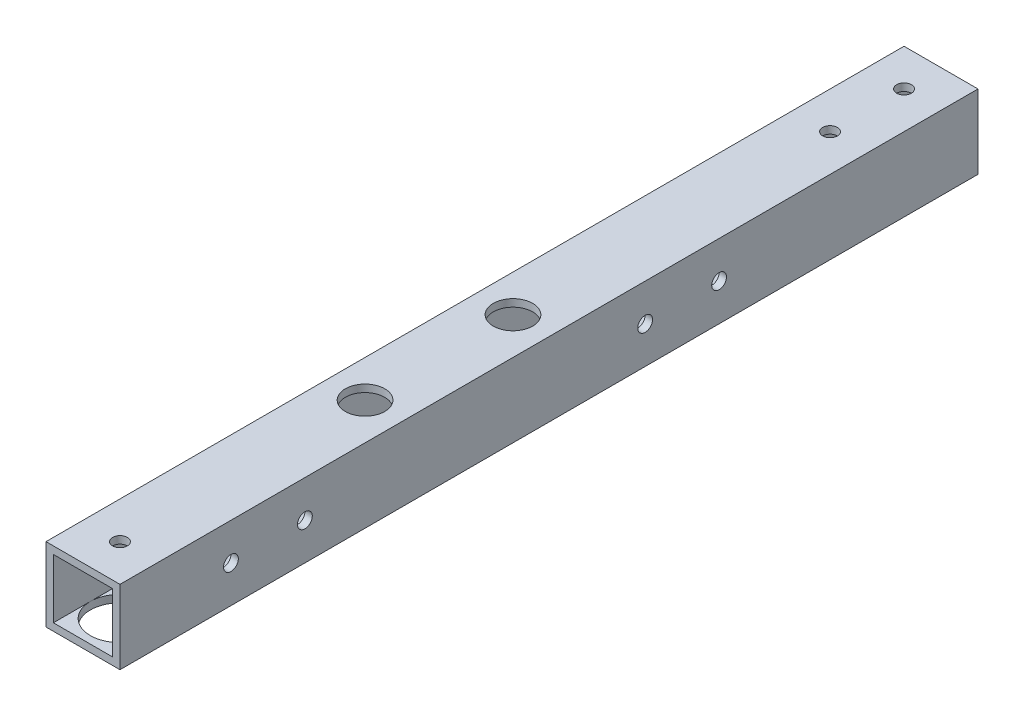
ISO-10303-21;
HEADER;
FILE_DESCRIPTION(('STEP AP214'),'2;1');
FILE_NAME('part.step','',(''),(''),'','','');
FILE_SCHEMA(('AUTOMOTIVE_DESIGN { 1 0 10303 214 1 1 1 1 }'));
ENDSEC;
DATA;
#1=APPLICATION_CONTEXT('core data for automotive mechanical design processes');
#2=APPLICATION_PROTOCOL_DEFINITION('international standard','automotive_design',2000,#1);
#3=PRODUCT_CONTEXT('',#1,'mechanical');
#4=PRODUCT('Part','Part','',(#3));
#5=PRODUCT_RELATED_PRODUCT_CATEGORY('part','',(#4));
#6=PRODUCT_DEFINITION_FORMATION('','',#4);
#7=PRODUCT_DEFINITION_CONTEXT('part definition',#1,'design');
#8=PRODUCT_DEFINITION('design','',#6,#7);
#9=PRODUCT_DEFINITION_SHAPE('','',#8);
#10=(LENGTH_UNIT() NAMED_UNIT(*) SI_UNIT(.MILLI.,.METRE.));
#11=(NAMED_UNIT(*) PLANE_ANGLE_UNIT() SI_UNIT($,.RADIAN.));
#12=(NAMED_UNIT(*) SI_UNIT($,.STERADIAN.) SOLID_ANGLE_UNIT());
#13=UNCERTAINTY_MEASURE_WITH_UNIT(LENGTH_MEASURE(1.E-05),#10,'distance_accuracy_value','');
#14=(GEOMETRIC_REPRESENTATION_CONTEXT(3) GLOBAL_UNCERTAINTY_ASSIGNED_CONTEXT((#13)) GLOBAL_UNIT_ASSIGNED_CONTEXT((#10,
#11,#12)) REPRESENTATION_CONTEXT('',''));
#15=CARTESIAN_POINT('',(0.,0.,0.));
#16=DIRECTION('',(0.,0.,1.));
#17=DIRECTION('',(1.,0.,0.));
#18=AXIS2_PLACEMENT_3D('',#15,#16,#17);
#19=CARTESIAN_POINT('',(-5.51008414074451,-5.76737391420748,174.));
#20=DIRECTION('',(0.,1.,0.));
#21=DIRECTION('',(0.,0.,1.));
#22=AXIS2_PLACEMENT_3D('',#19,#20,#21);
#23=PLANE('',#22);
#24=CARTESIAN_POINT('',(0.489915859255485,-5.76737391420748,22.5));
#25=DIRECTION('',(0.,1.,0.));
#26=DIRECTION('',(0.,0.,1.));
#27=AXIS2_PLACEMENT_3D('',#24,#25,#26);
#28=CIRCLE('',#27,6.);
#29=CARTESIAN_POINT('',(6.48991585925549,-5.76737391420748,22.5));
#30=VERTEX_POINT('',#29);
#31=CARTESIAN_POINT('',(-5.51008414074451,-5.76737391420748,22.5));
#32=VERTEX_POINT('',#31);
#33=EDGE_CURVE('E49',#30,#32,#28,.T.);
#34=ORIENTED_EDGE('',*,*,#33,.F.);
#35=DIRECTION('',(0.,0.,-1.));
#36=VECTOR('',#35,1.);
#37=CARTESIAN_POINT('',(6.48991585925549,-5.76737391420748,174.));
#38=LINE('',#37,#36);
#39=CARTESIAN_POINT('',(6.48991585925549,-5.76737391420748,0.));
#40=VERTEX_POINT('',#39);
#41=EDGE_CURVE('E121',#30,#40,#38,.T.);
#42=ORIENTED_EDGE('',*,*,#41,.T.);
#43=DIRECTION('',(1.,0.,0.));
#44=VECTOR('',#43,1.);
#45=CARTESIAN_POINT('',(-5.51008414074451,-5.76737391420748,0.));
#46=LINE('',#45,#44);
#47=CARTESIAN_POINT('',(-5.51008414074451,-5.76737391420748,0.));
#48=VERTEX_POINT('',#47);
#49=EDGE_CURVE('E281',#48,#40,#46,.T.);
#50=ORIENTED_EDGE('',*,*,#49,.F.);
#51=DIRECTION('',(0.,0.,-1.));
#52=VECTOR('',#51,1.);
#53=CARTESIAN_POINT('',(-5.51008414074451,-5.76737391420748,174.));
#54=LINE('',#53,#52);
#55=EDGE_CURVE('E123',#32,#48,#54,.T.);
#56=ORIENTED_EDGE('',*,*,#55,.F.);
#57=EDGE_LOOP('',(#34,#42,#50,#56));
#58=FACE_BOUND('',#57,.T.);
#59=ADVANCED_FACE('F33',(#58),#23,.T.);
#60=EDGE_CURVE('E109',#32,#30,#28,.T.);
#61=ORIENTED_EDGE('',*,*,#60,.F.);
#62=CARTESIAN_POINT('',(-5.51008414074451,-5.76737391420748,166.5));
#63=VERTEX_POINT('',#62);
#64=EDGE_CURVE('E147',#63,#32,#54,.T.);
#65=ORIENTED_EDGE('',*,*,#64,.F.);
#66=CARTESIAN_POINT('',(0.489915859255487,-5.76737391420748,166.5));
#67=DIRECTION('',(0.,1.,0.));
#68=DIRECTION('',(0.,0.,1.));
#69=AXIS2_PLACEMENT_3D('',#66,#67,#68);
#70=CIRCLE('',#69,6.);
#71=CARTESIAN_POINT('',(6.48991585925549,-5.76737391420748,166.5));
#72=VERTEX_POINT('',#71);
#73=EDGE_CURVE('E56',#72,#63,#70,.T.);
#74=ORIENTED_EDGE('',*,*,#73,.F.);
#75=EDGE_CURVE('E131',#72,#30,#38,.T.);
#76=ORIENTED_EDGE('',*,*,#75,.T.);
#77=EDGE_LOOP('',(#61,#65,#74,#76));
#78=FACE_BOUND('',#77,.T.);
#79=ADVANCED_FACE('F139',(#78),#23,.T.);
#80=CARTESIAN_POINT('',(0.,0.,174.));
#81=DIRECTION('',(0.,0.,1.));
#82=DIRECTION('',(1.,0.,0.));
#83=AXIS2_PLACEMENT_3D('',#80,#81,#82);
#84=PLANE('',#83);
#85=DIRECTION('',(0.,-1.,0.));
#86=VECTOR('',#85,1.);
#87=CARTESIAN_POINT('',(-7.01008414074451,7.73262608579252,174.));
#88=LINE('',#87,#86);
#89=CARTESIAN_POINT('',(-7.01008414074451,7.73262608579252,174.));
#90=VERTEX_POINT('',#89);
#91=CARTESIAN_POINT('',(-7.01008414074451,-7.26737391420748,174.));
#92=VERTEX_POINT('',#91);
#93=EDGE_CURVE('E148',#90,#92,#88,.T.);
#94=ORIENTED_EDGE('',*,*,#93,.T.);
#95=DIRECTION('',(1.,0.,0.));
#96=VECTOR('',#95,1.);
#97=CARTESIAN_POINT('',(-7.01008414074451,-7.26737391420748,174.));
#98=LINE('',#97,#96);
#99=CARTESIAN_POINT('',(7.98991585925548,-7.26737391420748,174.));
#100=VERTEX_POINT('',#99);
#101=EDGE_CURVE('E151',#92,#100,#98,.T.);
#102=ORIENTED_EDGE('',*,*,#101,.T.);
#103=DIRECTION('',(0.,1.,0.));
#104=VECTOR('',#103,1.);
#105=CARTESIAN_POINT('',(7.98991585925549,7.73262608579252,174.));
#106=LINE('',#105,#104);
#107=CARTESIAN_POINT('',(7.98991585925549,7.73262608579252,174.));
#108=VERTEX_POINT('',#107);
#109=EDGE_CURVE('E154',#100,#108,#106,.T.);
#110=ORIENTED_EDGE('',*,*,#109,.T.);
#111=DIRECTION('',(-1.,0.,0.));
#112=VECTOR('',#111,1.);
#113=CARTESIAN_POINT('',(-7.01008414074451,7.73262608579252,174.));
#114=LINE('',#113,#112);
#115=EDGE_CURVE('E156',#108,#90,#114,.T.);
#116=ORIENTED_EDGE('',*,*,#115,.T.);
#117=EDGE_LOOP('',(#94,#102,#110,#116));
#118=FACE_BOUND('',#117,.T.);
#119=DIRECTION('',(1.,0.,0.));
#120=VECTOR('',#119,1.);
#121=CARTESIAN_POINT('',(-5.51008414074451,-5.76737391420748,174.));
#122=LINE('',#121,#120);
#123=CARTESIAN_POINT('',(-5.51008414074451,-5.76737391420748,174.));
#124=VERTEX_POINT('',#123);
#125=CARTESIAN_POINT('',(6.48991585925549,-5.76737391420748,174.));
#126=VERTEX_POINT('',#125);
#127=EDGE_CURVE('E270',#124,#126,#122,.T.);
#128=ORIENTED_EDGE('',*,*,#127,.F.);
#129=DIRECTION('',(0.,-1.,0.));
#130=VECTOR('',#129,1.);
#131=CARTESIAN_POINT('',(-5.51008414074451,6.23262608579252,174.));
#132=LINE('',#131,#130);
#133=CARTESIAN_POINT('',(-5.51008414074451,6.23262608579252,174.));
#134=VERTEX_POINT('',#133);
#135=EDGE_CURVE('E268',#134,#124,#132,.T.);
#136=ORIENTED_EDGE('',*,*,#135,.F.);
#137=DIRECTION('',(-1.,0.,0.));
#138=VECTOR('',#137,1.);
#139=CARTESIAN_POINT('',(-5.51008414074451,6.23262608579252,174.));
#140=LINE('',#139,#138);
#141=CARTESIAN_POINT('',(6.48991585925549,6.23262608579252,174.));
#142=VERTEX_POINT('',#141);
#143=EDGE_CURVE('E276',#142,#134,#140,.T.);
#144=ORIENTED_EDGE('',*,*,#143,.F.);
#145=DIRECTION('',(0.,1.,0.));
#146=VECTOR('',#145,1.);
#147=CARTESIAN_POINT('',(6.48991585925549,6.23262608579252,174.));
#148=LINE('',#147,#146);
#149=EDGE_CURVE('E273',#126,#142,#148,.T.);
#150=ORIENTED_EDGE('',*,*,#149,.F.);
#151=EDGE_LOOP('',(#128,#136,#144,#150));
#152=FACE_BOUND('',#151,.T.);
#153=ADVANCED_FACE('F303',(#118,#152),#84,.T.);
#154=CARTESIAN_POINT('',(0.,0.,0.));
#155=DIRECTION('',(0.,0.,1.));
#156=DIRECTION('',(1.,0.,0.));
#157=AXIS2_PLACEMENT_3D('',#154,#155,#156);
#158=PLANE('',#157);
#159=DIRECTION('',(0.,-1.,0.));
#160=VECTOR('',#159,1.);
#161=CARTESIAN_POINT('',(-7.01008414074451,7.73262608579252,0.));
#162=LINE('',#161,#160);
#163=CARTESIAN_POINT('',(-7.01008414074451,7.73262608579252,0.));
#164=VERTEX_POINT('',#163);
#165=CARTESIAN_POINT('',(-7.01008414074451,-7.26737391420748,0.));
#166=VERTEX_POINT('',#165);
#167=EDGE_CURVE('E146',#164,#166,#162,.T.);
#168=ORIENTED_EDGE('',*,*,#167,.F.);
#169=DIRECTION('',(-1.,0.,0.));
#170=VECTOR('',#169,1.);
#171=CARTESIAN_POINT('',(-7.01008414074451,7.73262608579252,0.));
#172=LINE('',#171,#170);
#173=CARTESIAN_POINT('',(7.98991585925549,7.73262608579252,0.));
#174=VERTEX_POINT('',#173);
#175=EDGE_CURVE('E152',#174,#164,#172,.T.);
#176=ORIENTED_EDGE('',*,*,#175,.F.);
#177=DIRECTION('',(0.,1.,0.));
#178=VECTOR('',#177,1.);
#179=CARTESIAN_POINT('',(7.98991585925549,7.73262608579252,0.));
#180=LINE('',#179,#178);
#181=CARTESIAN_POINT('',(7.98991585925548,-7.26737391420748,0.));
#182=VERTEX_POINT('',#181);
#183=EDGE_CURVE('E163',#182,#174,#180,.T.);
#184=ORIENTED_EDGE('',*,*,#183,.F.);
#185=DIRECTION('',(1.,0.,0.));
#186=VECTOR('',#185,1.);
#187=CARTESIAN_POINT('',(-7.01008414074451,-7.26737391420748,0.));
#188=LINE('',#187,#186);
#189=EDGE_CURVE('E161',#166,#182,#188,.T.);
#190=ORIENTED_EDGE('',*,*,#189,.F.);
#191=EDGE_LOOP('',(#168,#176,#184,#190));
#192=FACE_BOUND('',#191,.T.);
#193=DIRECTION('',(0.,-1.,0.));
#194=VECTOR('',#193,1.);
#195=CARTESIAN_POINT('',(-5.51008414074451,6.23262608579252,0.));
#196=LINE('',#195,#194);
#197=CARTESIAN_POINT('',(-5.51008414074451,6.23262608579252,0.));
#198=VERTEX_POINT('',#197);
#199=EDGE_CURVE('E176',#198,#48,#196,.T.);
#200=ORIENTED_EDGE('',*,*,#199,.T.);
#201=ORIENTED_EDGE('',*,*,#49,.T.);
#202=DIRECTION('',(0.,1.,0.));
#203=VECTOR('',#202,1.);
#204=CARTESIAN_POINT('',(6.48991585925549,6.23262608579252,0.));
#205=LINE('',#204,#203);
#206=CARTESIAN_POINT('',(6.48991585925549,6.23262608579252,0.));
#207=VERTEX_POINT('',#206);
#208=EDGE_CURVE('E134',#40,#207,#205,.T.);
#209=ORIENTED_EDGE('',*,*,#208,.T.);
#210=DIRECTION('',(-1.,0.,0.));
#211=VECTOR('',#210,1.);
#212=CARTESIAN_POINT('',(-5.51008414074451,6.23262608579252,0.));
#213=LINE('',#212,#211);
#214=EDGE_CURVE('E271',#207,#198,#213,.T.);
#215=ORIENTED_EDGE('',*,*,#214,.T.);
#216=EDGE_LOOP('',(#200,#201,#209,#215));
#217=FACE_BOUND('',#216,.T.);
#218=ADVANCED_FACE('F293',(#192,#217),#158,.F.);
#219=CARTESIAN_POINT('',(-7.01008414074451,7.73262608579252,174.));
#220=DIRECTION('',(1.,0.,0.));
#221=DIRECTION('',(0.,1.,0.));
#222=AXIS2_PLACEMENT_3D('',#219,#220,#221);
#223=PLANE('',#222);
#224=CARTESIAN_POINT('',(-7.01008414074451,0.232626085792519,136.5));
#225=DIRECTION('',(-1.,0.,0.));
#226=DIRECTION('',(0.,-1.,0.));
#227=AXIS2_PLACEMENT_3D('',#224,#225,#226);
#228=CIRCLE('',#227,3.99999999999999);
#229=CARTESIAN_POINT('',(-7.01008414074451,-3.76737391420747,136.5));
#230=VERTEX_POINT('',#229);
#231=EDGE_CURVE('E222',#230,#230,#228,.T.);
#232=ORIENTED_EDGE('',*,*,#231,.F.);
#233=EDGE_LOOP('',(#232));
#234=FACE_BOUND('',#233,.T.);
#235=CARTESIAN_POINT('',(-7.01008414074451,0.232626085792519,67.5));
#236=DIRECTION('',(-1.,0.,0.));
#237=DIRECTION('',(0.,-1.,0.));
#238=AXIS2_PLACEMENT_3D('',#235,#236,#237);
#239=CIRCLE('',#238,4.00000000000001);
#240=CARTESIAN_POINT('',(-7.01008414074451,-3.76737391420749,67.5));
#241=VERTEX_POINT('',#240);
#242=EDGE_CURVE('E210',#241,#241,#239,.T.);
#243=ORIENTED_EDGE('',*,*,#242,.F.);
#244=EDGE_LOOP('',(#243));
#245=FACE_BOUND('',#244,.T.);
#246=CARTESIAN_POINT('',(-7.01008414074451,0.232626085792518,116.8));
#247=DIRECTION('',(-1.,0.,0.));
#248=DIRECTION('',(0.,-1.,0.));
#249=AXIS2_PLACEMENT_3D('',#246,#247,#248);
#250=CIRCLE('',#249,1.5);
#251=CARTESIAN_POINT('',(-7.01008414074451,-1.26737391420748,116.8));
#252=VERTEX_POINT('',#251);
#253=EDGE_CURVE('E197',#252,#252,#250,.T.);
#254=ORIENTED_EDGE('',*,*,#253,.F.);
#255=EDGE_LOOP('',(#254));
#256=FACE_BOUND('',#255,.T.);
#257=CARTESIAN_POINT('',(-7.01008414074451,0.232626085792518,86.8));
#258=DIRECTION('',(-1.,0.,0.));
#259=DIRECTION('',(0.,-1.,0.));
#260=AXIS2_PLACEMENT_3D('',#257,#258,#259);
#261=CIRCLE('',#260,1.5);
#262=CARTESIAN_POINT('',(-7.01008414074451,-1.26737391420748,86.8));
#263=VERTEX_POINT('',#262);
#264=EDGE_CURVE('E193',#263,#263,#261,.T.);
#265=ORIENTED_EDGE('',*,*,#264,.F.);
#266=EDGE_LOOP('',(#265));
#267=FACE_BOUND('',#266,.T.);
#268=CARTESIAN_POINT('',(-7.01008414074451,0.232626085792515,151.5));
#269=DIRECTION('',(-1.,0.,0.));
#270=DIRECTION('',(0.,-1.,0.));
#271=AXIS2_PLACEMENT_3D('',#268,#269,#270);
#272=CIRCLE('',#271,3.99999999999999);
#273=CARTESIAN_POINT('',(-7.01008414074451,-3.76737391420748,151.5));
#274=VERTEX_POINT('',#273);
#275=EDGE_CURVE('E189',#274,#274,#272,.T.);
#276=ORIENTED_EDGE('',*,*,#275,.F.);
#277=EDGE_LOOP('',(#276));
#278=FACE_BOUND('',#277,.T.);
#279=CARTESIAN_POINT('',(-7.01008414074451,0.232626085792518,52.5));
#280=DIRECTION('',(-1.,0.,0.));
#281=DIRECTION('',(0.,-1.,0.));
#282=AXIS2_PLACEMENT_3D('',#279,#280,#281);
#283=CIRCLE('',#282,4.);
#284=CARTESIAN_POINT('',(-7.01008414074451,-3.76737391420748,52.5));
#285=VERTEX_POINT('',#284);
#286=EDGE_CURVE('E181',#285,#285,#283,.T.);
#287=ORIENTED_EDGE('',*,*,#286,.F.);
#288=EDGE_LOOP('',(#287));
#289=FACE_BOUND('',#288,.T.);
#290=ORIENTED_EDGE('',*,*,#167,.T.);
#291=DIRECTION('',(0.,0.,-1.));
#292=VECTOR('',#291,1.);
#293=CARTESIAN_POINT('',(-7.01008414074451,-7.26737391420748,174.));
#294=LINE('',#293,#292);
#295=EDGE_CURVE('E11',#92,#166,#294,.T.);
#296=ORIENTED_EDGE('',*,*,#295,.F.);
#297=ORIENTED_EDGE('',*,*,#93,.F.);
#298=DIRECTION('',(0.,0.,-1.));
#299=VECTOR('',#298,1.);
#300=CARTESIAN_POINT('',(-7.01008414074451,7.73262608579252,174.));
#301=LINE('',#300,#299);
#302=EDGE_CURVE('E158',#90,#164,#301,.T.);
#303=ORIENTED_EDGE('',*,*,#302,.T.);
#304=EDGE_LOOP('',(#290,#296,#297,#303));
#305=FACE_BOUND('',#304,.T.);
#306=ADVANCED_FACE('F35',(#234,#245,#256,#267,#278,#289,#305),#223,.F.);
#307=CARTESIAN_POINT('',(-7.01008414074451,-7.26737391420748,174.));
#308=DIRECTION('',(0.,1.,0.));
#309=DIRECTION('',(0.,0.,1.));
#310=AXIS2_PLACEMENT_3D('',#307,#308,#309);
#311=PLANE('',#310);
#312=CARTESIAN_POINT('',(0.489915859255485,-7.26737391420748,22.5));
#313=DIRECTION('',(0.,-1.,0.));
#314=DIRECTION('',(0.,0.,-1.));
#315=AXIS2_PLACEMENT_3D('',#312,#313,#314);
#316=CIRCLE('',#315,6.);
#317=CARTESIAN_POINT('',(0.489915859255485,-7.26737391420748,16.5));
#318=VERTEX_POINT('',#317);
#319=EDGE_CURVE('E116',#318,#318,#316,.T.);
#320=ORIENTED_EDGE('',*,*,#319,.F.);
#321=EDGE_LOOP('',(#320));
#322=FACE_BOUND('',#321,.T.);
#323=CARTESIAN_POINT('',(0.489915859255487,-7.26737391420748,166.5));
#324=DIRECTION('',(0.,-1.,0.));
#325=DIRECTION('',(0.,0.,-1.));
#326=AXIS2_PLACEMENT_3D('',#323,#324,#325);
#327=CIRCLE('',#326,6.);
#328=CARTESIAN_POINT('',(0.489915859255487,-7.26737391420748,160.5));
#329=VERTEX_POINT('',#328);
#330=EDGE_CURVE('E205',#329,#329,#327,.T.);
#331=ORIENTED_EDGE('',*,*,#330,.F.);
#332=EDGE_LOOP('',(#331));
#333=FACE_BOUND('',#332,.T.);
#334=ORIENTED_EDGE('',*,*,#189,.T.);
#335=DIRECTION('',(0.,0.,-1.));
#336=VECTOR('',#335,1.);
#337=CARTESIAN_POINT('',(7.98991585925548,-7.26737391420748,174.));
#338=LINE('',#337,#336);
#339=EDGE_CURVE('E42',#100,#182,#338,.T.);
#340=ORIENTED_EDGE('',*,*,#339,.F.);
#341=ORIENTED_EDGE('',*,*,#101,.F.);
#342=ORIENTED_EDGE('',*,*,#295,.T.);
#343=EDGE_LOOP('',(#334,#340,#341,#342));
#344=FACE_BOUND('',#343,.T.);
#345=ADVANCED_FACE('F338',(#322,#333,#344),#311,.F.);
#346=CARTESIAN_POINT('',(7.98991585925549,7.73262608579252,174.));
#347=DIRECTION('',(-1.,0.,0.));
#348=DIRECTION('',(0.,-1.,0.));
#349=AXIS2_PLACEMENT_3D('',#346,#347,#348);
#350=PLANE('',#349);
#351=CARTESIAN_POINT('',(7.98991585925548,0.232626085792518,136.5));
#352=DIRECTION('',(1.,0.,0.));
#353=DIRECTION('',(0.,1.,0.));
#354=AXIS2_PLACEMENT_3D('',#351,#352,#353);
#355=CIRCLE('',#354,1.5);
#356=CARTESIAN_POINT('',(7.98991585925548,1.73262608579252,136.5));
#357=VERTEX_POINT('',#356);
#358=EDGE_CURVE('E218',#357,#357,#355,.T.);
#359=ORIENTED_EDGE('',*,*,#358,.F.);
#360=EDGE_LOOP('',(#359));
#361=FACE_BOUND('',#360,.T.);
#362=CARTESIAN_POINT('',(7.98991585925548,0.232626085792519,67.5));
#363=DIRECTION('',(1.,0.,0.));
#364=DIRECTION('',(0.,1.,0.));
#365=AXIS2_PLACEMENT_3D('',#362,#363,#364);
#366=CIRCLE('',#365,1.5);
#367=CARTESIAN_POINT('',(7.98991585925548,1.73262608579252,67.5));
#368=VERTEX_POINT('',#367);
#369=EDGE_CURVE('E214',#368,#368,#366,.T.);
#370=ORIENTED_EDGE('',*,*,#369,.F.);
#371=EDGE_LOOP('',(#370));
#372=FACE_BOUND('',#371,.T.);
#373=CARTESIAN_POINT('',(7.98991585925548,0.232626085792518,151.5));
#374=DIRECTION('',(1.,0.,0.));
#375=DIRECTION('',(0.,1.,0.));
#376=AXIS2_PLACEMENT_3D('',#373,#374,#375);
#377=CIRCLE('',#376,1.5);
#378=CARTESIAN_POINT('',(7.98991585925548,1.73262608579252,151.5));
#379=VERTEX_POINT('',#378);
#380=EDGE_CURVE('E185',#379,#379,#377,.T.);
#381=ORIENTED_EDGE('',*,*,#380,.F.);
#382=EDGE_LOOP('',(#381));
#383=FACE_BOUND('',#382,.T.);
#384=CARTESIAN_POINT('',(7.98991585925548,0.232626085792512,52.5));
#385=DIRECTION('',(1.,0.,0.));
#386=DIRECTION('',(0.,1.,0.));
#387=AXIS2_PLACEMENT_3D('',#384,#385,#386);
#388=CIRCLE('',#387,1.5);
#389=CARTESIAN_POINT('',(7.98991585925548,1.73262608579252,52.5));
#390=VERTEX_POINT('',#389);
#391=EDGE_CURVE('E177',#390,#390,#388,.T.);
#392=ORIENTED_EDGE('',*,*,#391,.F.);
#393=EDGE_LOOP('',(#392));
#394=FACE_BOUND('',#393,.T.);
#395=ORIENTED_EDGE('',*,*,#183,.T.);
#396=DIRECTION('',(0.,0.,-1.));
#397=VECTOR('',#396,1.);
#398=CARTESIAN_POINT('',(7.98991585925549,7.73262608579252,174.));
#399=LINE('',#398,#397);
#400=EDGE_CURVE('E168',#108,#174,#399,.T.);
#401=ORIENTED_EDGE('',*,*,#400,.F.);
#402=ORIENTED_EDGE('',*,*,#109,.F.);
#403=ORIENTED_EDGE('',*,*,#339,.T.);
#404=EDGE_LOOP('',(#395,#401,#402,#403));
#405=FACE_BOUND('',#404,.T.);
#406=ADVANCED_FACE('F332',(#361,#372,#383,#394,#405),#350,.F.);
#407=CARTESIAN_POINT('',(-7.01008414074451,7.73262608579252,174.));
#408=DIRECTION('',(0.,-1.,0.));
#409=DIRECTION('',(0.,0.,-1.));
#410=AXIS2_PLACEMENT_3D('',#407,#408,#409);
#411=PLANE('',#410);
#412=CARTESIAN_POINT('',(0.489915859255487,7.73262608579252,116.8));
#413=DIRECTION('',(0.,1.,0.));
#414=DIRECTION('',(0.,0.,1.));
#415=AXIS2_PLACEMENT_3D('',#412,#413,#414);
#416=CIRCLE('',#415,4.);
#417=CARTESIAN_POINT('',(0.489915859255487,7.73262608579252,120.8));
#418=VERTEX_POINT('',#417);
#419=EDGE_CURVE('E125',#418,#418,#416,.T.);
#420=ORIENTED_EDGE('',*,*,#419,.F.);
#421=EDGE_LOOP('',(#420));
#422=FACE_BOUND('',#421,.T.);
#423=CARTESIAN_POINT('',(0.489915859255487,7.73262608579252,86.8));
#424=DIRECTION('',(0.,1.,0.));
#425=DIRECTION('',(0.,0.,1.));
#426=AXIS2_PLACEMENT_3D('',#423,#424,#425);
#427=CIRCLE('',#426,4.);
#428=CARTESIAN_POINT('',(0.489915859255487,7.73262608579252,90.8));
#429=VERTEX_POINT('',#428);
#430=EDGE_CURVE('E228',#429,#429,#427,.T.);
#431=ORIENTED_EDGE('',*,*,#430,.F.);
#432=EDGE_LOOP('',(#431));
#433=FACE_BOUND('',#432,.T.);
#434=CARTESIAN_POINT('',(0.489915859255487,7.73262608579252,7.5));
#435=DIRECTION('',(0.,1.,0.));
#436=DIRECTION('',(0.,0.,1.));
#437=AXIS2_PLACEMENT_3D('',#434,#435,#436);
#438=CIRCLE('',#437,1.5);
#439=CARTESIAN_POINT('',(0.489915859255487,7.73262608579252,9.));
#440=VERTEX_POINT('',#439);
#441=EDGE_CURVE('E225',#440,#440,#438,.T.);
#442=ORIENTED_EDGE('',*,*,#441,.F.);
#443=EDGE_LOOP('',(#442));
#444=FACE_BOUND('',#443,.T.);
#445=CARTESIAN_POINT('',(0.489915859255486,7.73262608579252,166.5));
#446=DIRECTION('',(0.,1.,0.));
#447=DIRECTION('',(0.,0.,1.));
#448=AXIS2_PLACEMENT_3D('',#445,#446,#447);
#449=CIRCLE('',#448,1.5);
#450=CARTESIAN_POINT('',(0.489915859255486,7.73262608579252,168.));
#451=VERTEX_POINT('',#450);
#452=EDGE_CURVE('E206',#451,#451,#449,.T.);
#453=ORIENTED_EDGE('',*,*,#452,.F.);
#454=EDGE_LOOP('',(#453));
#455=FACE_BOUND('',#454,.T.);
#456=CARTESIAN_POINT('',(0.489915859255489,7.73262608579252,22.5));
#457=DIRECTION('',(0.,1.,0.));
#458=DIRECTION('',(0.,0.,1.));
#459=AXIS2_PLACEMENT_3D('',#456,#457,#458);
#460=CIRCLE('',#459,1.5);
#461=CARTESIAN_POINT('',(0.489915859255489,7.73262608579252,24.));
#462=VERTEX_POINT('',#461);
#463=EDGE_CURVE('E201',#462,#462,#460,.T.);
#464=ORIENTED_EDGE('',*,*,#463,.F.);
#465=EDGE_LOOP('',(#464));
#466=FACE_BOUND('',#465,.T.);
#467=ORIENTED_EDGE('',*,*,#175,.T.);
#468=ORIENTED_EDGE('',*,*,#302,.F.);
#469=ORIENTED_EDGE('',*,*,#115,.F.);
#470=ORIENTED_EDGE('',*,*,#400,.T.);
#471=EDGE_LOOP('',(#467,#468,#469,#470));
#472=FACE_BOUND('',#471,.T.);
#473=ADVANCED_FACE('F328',(#422,#433,#444,#455,#466,#472),#411,.F.);
#474=CARTESIAN_POINT('',(-5.51008414074451,6.23262608579252,174.));
#475=DIRECTION('',(1.,0.,0.));
#476=DIRECTION('',(0.,1.,0.));
#477=AXIS2_PLACEMENT_3D('',#474,#475,#476);
#478=PLANE('',#477);
#479=ORIENTED_EDGE('',*,*,#64,.T.);
#480=ORIENTED_EDGE('',*,*,#55,.T.);
#481=ORIENTED_EDGE('',*,*,#199,.F.);
#482=DIRECTION('',(0.,0.,-1.));
#483=VECTOR('',#482,1.);
#484=CARTESIAN_POINT('',(-5.51008414074451,6.23262608579252,174.));
#485=LINE('',#484,#483);
#486=EDGE_CURVE('E278',#134,#198,#485,.T.);
#487=ORIENTED_EDGE('',*,*,#486,.F.);
#488=ORIENTED_EDGE('',*,*,#135,.T.);
#489=EDGE_CURVE('E143',#124,#63,#54,.T.);
#490=ORIENTED_EDGE('',*,*,#489,.T.);
#491=EDGE_LOOP('',(#479,#480,#481,#487,#488,#490));
#492=FACE_BOUND('',#491,.T.);
#493=CARTESIAN_POINT('',(-5.51008414074451,0.232626085792519,136.5));
#494=DIRECTION('',(1.,0.,0.));
#495=DIRECTION('',(0.,1.,0.));
#496=AXIS2_PLACEMENT_3D('',#493,#494,#495);
#497=CIRCLE('',#496,3.99999999999999);
#498=CARTESIAN_POINT('',(-5.51008414074451,4.23262608579251,136.5));
#499=VERTEX_POINT('',#498);
#500=EDGE_CURVE('E219',#499,#499,#497,.T.);
#501=ORIENTED_EDGE('',*,*,#500,.F.);
#502=EDGE_LOOP('',(#501));
#503=FACE_BOUND('',#502,.T.);
#504=CARTESIAN_POINT('',(-5.51008414074451,0.232626085792519,67.5));
#505=DIRECTION('',(1.,0.,0.));
#506=DIRECTION('',(0.,1.,0.));
#507=AXIS2_PLACEMENT_3D('',#504,#505,#506);
#508=CIRCLE('',#507,4.00000000000001);
#509=CARTESIAN_POINT('',(-5.51008414074451,4.23262608579253,67.5));
#510=VERTEX_POINT('',#509);
#511=EDGE_CURVE('E207',#510,#510,#508,.T.);
#512=ORIENTED_EDGE('',*,*,#511,.F.);
#513=EDGE_LOOP('',(#512));
#514=FACE_BOUND('',#513,.T.);
#515=CARTESIAN_POINT('',(-5.51008414074451,0.232626085792519,116.8));
#516=DIRECTION('',(1.,0.,0.));
#517=DIRECTION('',(0.,1.,0.));
#518=AXIS2_PLACEMENT_3D('',#515,#516,#517);
#519=CIRCLE('',#518,1.5);
#520=CARTESIAN_POINT('',(-5.51008414074451,1.73262608579252,116.8));
#521=VERTEX_POINT('',#520);
#522=EDGE_CURVE('E194',#521,#521,#519,.T.);
#523=ORIENTED_EDGE('',*,*,#522,.F.);
#524=EDGE_LOOP('',(#523));
#525=FACE_BOUND('',#524,.T.);
#526=CARTESIAN_POINT('',(-5.51008414074451,0.232626085792519,86.8));
#527=DIRECTION('',(1.,0.,0.));
#528=DIRECTION('',(0.,1.,0.));
#529=AXIS2_PLACEMENT_3D('',#526,#527,#528);
#530=CIRCLE('',#529,1.5);
#531=CARTESIAN_POINT('',(-5.51008414074451,1.73262608579252,86.8));
#532=VERTEX_POINT('',#531);
#533=EDGE_CURVE('E190',#532,#532,#530,.T.);
#534=ORIENTED_EDGE('',*,*,#533,.F.);
#535=EDGE_LOOP('',(#534));
#536=FACE_BOUND('',#535,.T.);
#537=CARTESIAN_POINT('',(-5.51008414074451,0.232626085792516,151.5));
#538=DIRECTION('',(1.,0.,0.));
#539=DIRECTION('',(0.,1.,0.));
#540=AXIS2_PLACEMENT_3D('',#537,#538,#539);
#541=CIRCLE('',#540,3.99999999999999);
#542=CARTESIAN_POINT('',(-5.51008414074451,4.23262608579251,151.5));
#543=VERTEX_POINT('',#542);
#544=EDGE_CURVE('E186',#543,#543,#541,.T.);
#545=ORIENTED_EDGE('',*,*,#544,.F.);
#546=EDGE_LOOP('',(#545));
#547=FACE_BOUND('',#546,.T.);
#548=CARTESIAN_POINT('',(-5.51008414074451,0.232626085792519,52.5));
#549=DIRECTION('',(1.,0.,0.));
#550=DIRECTION('',(0.,1.,0.));
#551=AXIS2_PLACEMENT_3D('',#548,#549,#550);
#552=CIRCLE('',#551,4.);
#553=CARTESIAN_POINT('',(-5.51008414074451,4.23262608579252,52.5));
#554=VERTEX_POINT('',#553);
#555=EDGE_CURVE('E178',#554,#554,#552,.T.);
#556=ORIENTED_EDGE('',*,*,#555,.F.);
#557=EDGE_LOOP('',(#556));
#558=FACE_BOUND('',#557,.T.);
#559=ADVANCED_FACE('F295',(#492,#503,#514,#525,#536,#547,#558),#478,.T.);
#560=EDGE_CURVE('E252',#63,#72,#70,.T.);
#561=ORIENTED_EDGE('',*,*,#560,.F.);
#562=ORIENTED_EDGE('',*,*,#489,.F.);
#563=ORIENTED_EDGE('',*,*,#127,.T.);
#564=EDGE_CURVE('E138',#126,#72,#38,.T.);
#565=ORIENTED_EDGE('',*,*,#564,.T.);
#566=EDGE_LOOP('',(#561,#562,#563,#565));
#567=FACE_BOUND('',#566,.T.);
#568=ADVANCED_FACE('F301',(#567),#23,.T.);
#569=CARTESIAN_POINT('',(6.48991585925549,6.23262608579252,174.));
#570=DIRECTION('',(-1.,0.,0.));
#571=DIRECTION('',(0.,-1.,0.));
#572=AXIS2_PLACEMENT_3D('',#569,#570,#571);
#573=PLANE('',#572);
#574=ORIENTED_EDGE('',*,*,#41,.F.);
#575=ORIENTED_EDGE('',*,*,#75,.F.);
#576=ORIENTED_EDGE('',*,*,#564,.F.);
#577=ORIENTED_EDGE('',*,*,#149,.T.);
#578=DIRECTION('',(0.,0.,-1.));
#579=VECTOR('',#578,1.);
#580=CARTESIAN_POINT('',(6.48991585925549,6.23262608579252,174.));
#581=LINE('',#580,#579);
#582=EDGE_CURVE('E136',#142,#207,#581,.T.);
#583=ORIENTED_EDGE('',*,*,#582,.T.);
#584=ORIENTED_EDGE('',*,*,#208,.F.);
#585=EDGE_LOOP('',(#574,#575,#576,#577,#583,#584));
#586=FACE_BOUND('',#585,.T.);
#587=CARTESIAN_POINT('',(6.48991585925549,0.232626085792519,136.5));
#588=DIRECTION('',(-1.,0.,0.));
#589=DIRECTION('',(0.,-1.,0.));
#590=AXIS2_PLACEMENT_3D('',#587,#588,#589);
#591=CIRCLE('',#590,1.5);
#592=CARTESIAN_POINT('',(6.48991585925549,-1.26737391420748,136.5));
#593=VERTEX_POINT('',#592);
#594=EDGE_CURVE('E215',#593,#593,#591,.T.);
#595=ORIENTED_EDGE('',*,*,#594,.F.);
#596=EDGE_LOOP('',(#595));
#597=FACE_BOUND('',#596,.T.);
#598=CARTESIAN_POINT('',(6.48991585925549,0.232626085792519,67.5));
#599=DIRECTION('',(-1.,0.,0.));
#600=DIRECTION('',(0.,-1.,0.));
#601=AXIS2_PLACEMENT_3D('',#598,#599,#600);
#602=CIRCLE('',#601,1.5);
#603=CARTESIAN_POINT('',(6.48991585925549,-1.26737391420748,67.5));
#604=VERTEX_POINT('',#603);
#605=EDGE_CURVE('E211',#604,#604,#602,.T.);
#606=ORIENTED_EDGE('',*,*,#605,.F.);
#607=EDGE_LOOP('',(#606));
#608=FACE_BOUND('',#607,.T.);
#609=CARTESIAN_POINT('',(6.48991585925549,0.232626085792519,151.5));
#610=DIRECTION('',(-1.,0.,0.));
#611=DIRECTION('',(0.,-1.,0.));
#612=AXIS2_PLACEMENT_3D('',#609,#610,#611);
#613=CIRCLE('',#612,1.5);
#614=CARTESIAN_POINT('',(6.48991585925549,-1.26737391420748,151.5));
#615=VERTEX_POINT('',#614);
#616=EDGE_CURVE('E182',#615,#615,#613,.T.);
#617=ORIENTED_EDGE('',*,*,#616,.F.);
#618=EDGE_LOOP('',(#617));
#619=FACE_BOUND('',#618,.T.);
#620=CARTESIAN_POINT('',(6.48991585925549,0.232626085792512,52.5));
#621=DIRECTION('',(-1.,0.,0.));
#622=DIRECTION('',(0.,-1.,0.));
#623=AXIS2_PLACEMENT_3D('',#620,#621,#622);
#624=CIRCLE('',#623,1.5);
#625=CARTESIAN_POINT('',(6.48991585925549,-1.26737391420749,52.5));
#626=VERTEX_POINT('',#625);
#627=EDGE_CURVE('E173',#626,#626,#624,.T.);
#628=ORIENTED_EDGE('',*,*,#627,.F.);
#629=EDGE_LOOP('',(#628));
#630=FACE_BOUND('',#629,.T.);
#631=ADVANCED_FACE('F128',(#586,#597,#608,#619,#630),#573,.T.);
#632=CARTESIAN_POINT('',(-5.51008414074451,6.23262608579252,174.));
#633=DIRECTION('',(0.,-1.,0.));
#634=DIRECTION('',(0.,0.,-1.));
#635=AXIS2_PLACEMENT_3D('',#632,#633,#634);
#636=PLANE('',#635);
#637=CARTESIAN_POINT('',(0.489915859255487,6.23262608579252,116.8));
#638=DIRECTION('',(0.,-1.,0.));
#639=DIRECTION('',(0.,0.,-1.));
#640=AXIS2_PLACEMENT_3D('',#637,#638,#639);
#641=CIRCLE('',#640,4.);
#642=CARTESIAN_POINT('',(0.489915859255487,6.23262608579252,112.8));
#643=VERTEX_POINT('',#642);
#644=EDGE_CURVE('E37',#643,#643,#641,.T.);
#645=ORIENTED_EDGE('',*,*,#644,.F.);
#646=EDGE_LOOP('',(#645));
#647=FACE_BOUND('',#646,.T.);
#648=CARTESIAN_POINT('',(0.489915859255487,6.23262608579252,86.8));
#649=DIRECTION('',(0.,-1.,0.));
#650=DIRECTION('',(0.,0.,-1.));
#651=AXIS2_PLACEMENT_3D('',#648,#649,#650);
#652=CIRCLE('',#651,4.);
#653=CARTESIAN_POINT('',(0.489915859255487,6.23262608579252,82.8));
#654=VERTEX_POINT('',#653);
#655=EDGE_CURVE('E226',#654,#654,#652,.T.);
#656=ORIENTED_EDGE('',*,*,#655,.F.);
#657=EDGE_LOOP('',(#656));
#658=FACE_BOUND('',#657,.T.);
#659=CARTESIAN_POINT('',(0.489915859255487,6.23262608579252,7.5));
#660=DIRECTION('',(0.,-1.,0.));
#661=DIRECTION('',(0.,0.,-1.));
#662=AXIS2_PLACEMENT_3D('',#659,#660,#661);
#663=CIRCLE('',#662,1.5);
#664=CARTESIAN_POINT('',(0.489915859255487,6.23262608579252,6.));
#665=VERTEX_POINT('',#664);
#666=EDGE_CURVE('E223',#665,#665,#663,.T.);
#667=ORIENTED_EDGE('',*,*,#666,.F.);
#668=EDGE_LOOP('',(#667));
#669=FACE_BOUND('',#668,.T.);
#670=CARTESIAN_POINT('',(0.489915859255486,6.23262608579252,166.5));
#671=DIRECTION('',(0.,-1.,0.));
#672=DIRECTION('',(0.,0.,-1.));
#673=AXIS2_PLACEMENT_3D('',#670,#671,#672);
#674=CIRCLE('',#673,1.5);
#675=CARTESIAN_POINT('',(0.489915859255486,6.23262608579252,165.));
#676=VERTEX_POINT('',#675);
#677=EDGE_CURVE('E202',#676,#676,#674,.T.);
#678=ORIENTED_EDGE('',*,*,#677,.F.);
#679=EDGE_LOOP('',(#678));
#680=FACE_BOUND('',#679,.T.);
#681=CARTESIAN_POINT('',(0.489915859255489,6.23262608579252,22.5));
#682=DIRECTION('',(0.,-1.,0.));
#683=DIRECTION('',(0.,0.,-1.));
#684=AXIS2_PLACEMENT_3D('',#681,#682,#683);
#685=CIRCLE('',#684,1.5);
#686=CARTESIAN_POINT('',(0.489915859255489,6.23262608579252,21.));
#687=VERTEX_POINT('',#686);
#688=EDGE_CURVE('E198',#687,#687,#685,.T.);
#689=ORIENTED_EDGE('',*,*,#688,.F.);
#690=EDGE_LOOP('',(#689));
#691=FACE_BOUND('',#690,.T.);
#692=ORIENTED_EDGE('',*,*,#214,.F.);
#693=ORIENTED_EDGE('',*,*,#582,.F.);
#694=ORIENTED_EDGE('',*,*,#143,.T.);
#695=ORIENTED_EDGE('',*,*,#486,.T.);
#696=EDGE_LOOP('',(#692,#693,#694,#695));
#697=FACE_BOUND('',#696,.T.);
#698=ADVANCED_FACE('F291',(#647,#658,#669,#680,#691,#697),#636,.T.);
#699=CARTESIAN_POINT('',(-2.01008414074452,0.232626085792514,52.5));
#700=DIRECTION('',(1.,0.,0.));
#701=DIRECTION('',(0.,1.,0.));
#702=AXIS2_PLACEMENT_3D('',#699,#700,#701);
#703=CYLINDRICAL_SURFACE('',#702,1.5);
#704=ORIENTED_EDGE('',*,*,#627,.T.);
#705=EDGE_LOOP('',(#704));
#706=FACE_BOUND('',#705,.T.);
#707=ORIENTED_EDGE('',*,*,#391,.T.);
#708=EDGE_LOOP('',(#707));
#709=FACE_BOUND('',#708,.T.);
#710=ADVANCED_FACE('F402',(#706,#709),#703,.F.);
#711=CARTESIAN_POINT('',(2.98991585925549,0.23262608579252,52.5));
#712=DIRECTION('',(-1.,0.,0.));
#713=DIRECTION('',(0.,-1.,0.));
#714=AXIS2_PLACEMENT_3D('',#711,#712,#713);
#715=CYLINDRICAL_SURFACE('',#714,4.);
#716=ORIENTED_EDGE('',*,*,#555,.T.);
#717=EDGE_LOOP('',(#716));
#718=FACE_BOUND('',#717,.T.);
#719=ORIENTED_EDGE('',*,*,#286,.T.);
#720=EDGE_LOOP('',(#719));
#721=FACE_BOUND('',#720,.T.);
#722=ADVANCED_FACE('F398',(#718,#721),#715,.F.);
#723=CARTESIAN_POINT('',(-2.01008414074452,0.232626085792521,151.5));
#724=DIRECTION('',(1.,0.,0.));
#725=DIRECTION('',(0.,1.,0.));
#726=AXIS2_PLACEMENT_3D('',#723,#724,#725);
#727=CYLINDRICAL_SURFACE('',#726,1.5);
#728=ORIENTED_EDGE('',*,*,#616,.T.);
#729=EDGE_LOOP('',(#728));
#730=FACE_BOUND('',#729,.T.);
#731=ORIENTED_EDGE('',*,*,#380,.T.);
#732=EDGE_LOOP('',(#731));
#733=FACE_BOUND('',#732,.T.);
#734=ADVANCED_FACE('F394',(#730,#733),#727,.F.);
#735=CARTESIAN_POINT('',(2.98991585925549,0.232626085792517,151.5));
#736=DIRECTION('',(-1.,0.,0.));
#737=DIRECTION('',(0.,-1.,0.));
#738=AXIS2_PLACEMENT_3D('',#735,#736,#737);
#739=CYLINDRICAL_SURFACE('',#738,3.99999999999999);
#740=ORIENTED_EDGE('',*,*,#544,.T.);
#741=EDGE_LOOP('',(#740));
#742=FACE_BOUND('',#741,.T.);
#743=ORIENTED_EDGE('',*,*,#275,.T.);
#744=EDGE_LOOP('',(#743));
#745=FACE_BOUND('',#744,.T.);
#746=ADVANCED_FACE('F390',(#742,#745),#739,.F.);
#747=CARTESIAN_POINT('',(2.98991585925549,0.23262608579252,86.8));
#748=DIRECTION('',(-1.,0.,0.));
#749=DIRECTION('',(0.,-1.,0.));
#750=AXIS2_PLACEMENT_3D('',#747,#748,#749);
#751=CYLINDRICAL_SURFACE('',#750,1.5);
#752=ORIENTED_EDGE('',*,*,#533,.T.);
#753=EDGE_LOOP('',(#752));
#754=FACE_BOUND('',#753,.T.);
#755=ORIENTED_EDGE('',*,*,#264,.T.);
#756=EDGE_LOOP('',(#755));
#757=FACE_BOUND('',#756,.T.);
#758=ADVANCED_FACE('F386',(#754,#757),#751,.F.);
#759=CARTESIAN_POINT('',(2.98991585925549,0.23262608579252,116.8));
#760=DIRECTION('',(-1.,0.,0.));
#761=DIRECTION('',(0.,-1.,0.));
#762=AXIS2_PLACEMENT_3D('',#759,#760,#761);
#763=CYLINDRICAL_SURFACE('',#762,1.5);
#764=ORIENTED_EDGE('',*,*,#522,.T.);
#765=EDGE_LOOP('',(#764));
#766=FACE_BOUND('',#765,.T.);
#767=ORIENTED_EDGE('',*,*,#253,.T.);
#768=EDGE_LOOP('',(#767));
#769=FACE_BOUND('',#768,.T.);
#770=ADVANCED_FACE('F379',(#766,#769),#763,.F.);
#771=CARTESIAN_POINT('',(0.489915859255489,-2.26737391420748,22.5));
#772=DIRECTION('',(0.,1.,0.));
#773=DIRECTION('',(0.,0.,1.));
#774=AXIS2_PLACEMENT_3D('',#771,#772,#773);
#775=CYLINDRICAL_SURFACE('',#774,1.5);
#776=ORIENTED_EDGE('',*,*,#688,.T.);
#777=EDGE_LOOP('',(#776));
#778=FACE_BOUND('',#777,.T.);
#779=ORIENTED_EDGE('',*,*,#463,.T.);
#780=EDGE_LOOP('',(#779));
#781=FACE_BOUND('',#780,.T.);
#782=ADVANCED_FACE('F370',(#778,#781),#775,.F.);
#783=CARTESIAN_POINT('',(0.489915859255487,2.73262608579252,166.5));
#784=DIRECTION('',(0.,-1.,0.));
#785=DIRECTION('',(0.,0.,-1.));
#786=AXIS2_PLACEMENT_3D('',#783,#784,#785);
#787=CYLINDRICAL_SURFACE('',#786,6.);
#788=ORIENTED_EDGE('',*,*,#73,.T.);
#789=ORIENTED_EDGE('',*,*,#560,.T.);
#790=EDGE_LOOP('',(#788,#789));
#791=FACE_BOUND('',#790,.T.);
#792=ORIENTED_EDGE('',*,*,#330,.T.);
#793=EDGE_LOOP('',(#792));
#794=FACE_BOUND('',#793,.T.);
#795=ADVANCED_FACE('F367',(#791,#794),#787,.F.);
#796=CARTESIAN_POINT('',(0.489915859255486,-2.26737391420748,166.5));
#797=DIRECTION('',(0.,1.,0.));
#798=DIRECTION('',(0.,0.,1.));
#799=AXIS2_PLACEMENT_3D('',#796,#797,#798);
#800=CYLINDRICAL_SURFACE('',#799,1.5);
#801=ORIENTED_EDGE('',*,*,#677,.T.);
#802=EDGE_LOOP('',(#801));
#803=FACE_BOUND('',#802,.T.);
#804=ORIENTED_EDGE('',*,*,#452,.T.);
#805=EDGE_LOOP('',(#804));
#806=FACE_BOUND('',#805,.T.);
#807=ADVANCED_FACE('F369',(#803,#806),#800,.F.);
#808=CARTESIAN_POINT('',(2.98991585925549,0.232626085792521,67.5));
#809=DIRECTION('',(-1.,0.,0.));
#810=DIRECTION('',(0.,-1.,0.));
#811=AXIS2_PLACEMENT_3D('',#808,#809,#810);
#812=CYLINDRICAL_SURFACE('',#811,4.00000000000001);
#813=ORIENTED_EDGE('',*,*,#511,.T.);
#814=EDGE_LOOP('',(#813));
#815=FACE_BOUND('',#814,.T.);
#816=ORIENTED_EDGE('',*,*,#242,.T.);
#817=EDGE_LOOP('',(#816));
#818=FACE_BOUND('',#817,.T.);
#819=ADVANCED_FACE('F376',(#815,#818),#812,.F.);
#820=CARTESIAN_POINT('',(-2.01008414074452,0.232626085792521,67.5));
#821=DIRECTION('',(1.,0.,0.));
#822=DIRECTION('',(0.,1.,0.));
#823=AXIS2_PLACEMENT_3D('',#820,#821,#822);
#824=CYLINDRICAL_SURFACE('',#823,1.5);
#825=ORIENTED_EDGE('',*,*,#605,.T.);
#826=EDGE_LOOP('',(#825));
#827=FACE_BOUND('',#826,.T.);
#828=ORIENTED_EDGE('',*,*,#369,.T.);
#829=EDGE_LOOP('',(#828));
#830=FACE_BOUND('',#829,.T.);
#831=ADVANCED_FACE('F447',(#827,#830),#824,.F.);
#832=CARTESIAN_POINT('',(-2.01008414074452,0.232626085792521,136.5));
#833=DIRECTION('',(1.,0.,0.));
#834=DIRECTION('',(0.,1.,0.));
#835=AXIS2_PLACEMENT_3D('',#832,#833,#834);
#836=CYLINDRICAL_SURFACE('',#835,1.5);
#837=ORIENTED_EDGE('',*,*,#594,.T.);
#838=EDGE_LOOP('',(#837));
#839=FACE_BOUND('',#838,.T.);
#840=ORIENTED_EDGE('',*,*,#358,.T.);
#841=EDGE_LOOP('',(#840));
#842=FACE_BOUND('',#841,.T.);
#843=ADVANCED_FACE('F440',(#839,#842),#836,.F.);
#844=CARTESIAN_POINT('',(2.98991585925549,0.23262608579252,136.5));
#845=DIRECTION('',(-1.,0.,0.));
#846=DIRECTION('',(0.,-1.,0.));
#847=AXIS2_PLACEMENT_3D('',#844,#845,#846);
#848=CYLINDRICAL_SURFACE('',#847,3.99999999999999);
#849=ORIENTED_EDGE('',*,*,#500,.T.);
#850=EDGE_LOOP('',(#849));
#851=FACE_BOUND('',#850,.T.);
#852=ORIENTED_EDGE('',*,*,#231,.T.);
#853=EDGE_LOOP('',(#852));
#854=FACE_BOUND('',#853,.T.);
#855=ADVANCED_FACE('F430',(#851,#854),#848,.F.);
#856=CARTESIAN_POINT('',(0.489915859255487,-2.26737391420748,7.5));
#857=DIRECTION('',(0.,1.,0.));
#858=DIRECTION('',(0.,0.,1.));
#859=AXIS2_PLACEMENT_3D('',#856,#857,#858);
#860=CYLINDRICAL_SURFACE('',#859,1.5);
#861=ORIENTED_EDGE('',*,*,#666,.T.);
#862=EDGE_LOOP('',(#861));
#863=FACE_BOUND('',#862,.T.);
#864=ORIENTED_EDGE('',*,*,#441,.T.);
#865=EDGE_LOOP('',(#864));
#866=FACE_BOUND('',#865,.T.);
#867=ADVANCED_FACE('F426',(#863,#866),#860,.F.);
#868=CARTESIAN_POINT('',(0.489915859255487,-2.26737391420748,86.8));
#869=DIRECTION('',(0.,1.,0.));
#870=DIRECTION('',(0.,0.,1.));
#871=AXIS2_PLACEMENT_3D('',#868,#869,#870);
#872=CYLINDRICAL_SURFACE('',#871,4.);
#873=ORIENTED_EDGE('',*,*,#655,.T.);
#874=EDGE_LOOP('',(#873));
#875=FACE_BOUND('',#874,.T.);
#876=ORIENTED_EDGE('',*,*,#430,.T.);
#877=EDGE_LOOP('',(#876));
#878=FACE_BOUND('',#877,.T.);
#879=ADVANCED_FACE('F429',(#875,#878),#872,.F.);
#880=CARTESIAN_POINT('',(0.489915859255487,-2.26737391420748,116.8));
#881=DIRECTION('',(0.,1.,0.));
#882=DIRECTION('',(0.,0.,1.));
#883=AXIS2_PLACEMENT_3D('',#880,#881,#882);
#884=CYLINDRICAL_SURFACE('',#883,4.);
#885=ORIENTED_EDGE('',*,*,#644,.T.);
#886=EDGE_LOOP('',(#885));
#887=FACE_BOUND('',#886,.T.);
#888=ORIENTED_EDGE('',*,*,#419,.T.);
#889=EDGE_LOOP('',(#888));
#890=FACE_BOUND('',#889,.T.);
#891=ADVANCED_FACE('F438',(#887,#890),#884,.F.);
#892=CARTESIAN_POINT('',(0.489915859255485,2.73262608579252,22.5));
#893=DIRECTION('',(0.,-1.,0.));
#894=DIRECTION('',(0.,0.,-1.));
#895=AXIS2_PLACEMENT_3D('',#892,#893,#894);
#896=CYLINDRICAL_SURFACE('',#895,6.);
#897=ORIENTED_EDGE('',*,*,#33,.T.);
#898=ORIENTED_EDGE('',*,*,#60,.T.);
#899=EDGE_LOOP('',(#897,#898));
#900=FACE_BOUND('',#899,.T.);
#901=ORIENTED_EDGE('',*,*,#319,.T.);
#902=EDGE_LOOP('',(#901));
#903=FACE_BOUND('',#902,.T.);
#904=ADVANCED_FACE('F110',(#900,#903),#896,.F.);
#905=CLOSED_SHELL('',(#59,#79,#153,#218,#306,#345,#406,#473,#559,#568,#631,#698,#710,#722,#734,
#746,#758,#770,#782,#795,#807,#819,#831,#843,#855,#867,#879,#891,#904));
#906=MANIFOLD_SOLID_BREP('B2',#905);
#907=ADVANCED_BREP_SHAPE_REPRESENTATION('',(#18,#906),#14);
#908=SHAPE_DEFINITION_REPRESENTATION(#9,#907);
ENDSEC;
END-ISO-10303-21;
